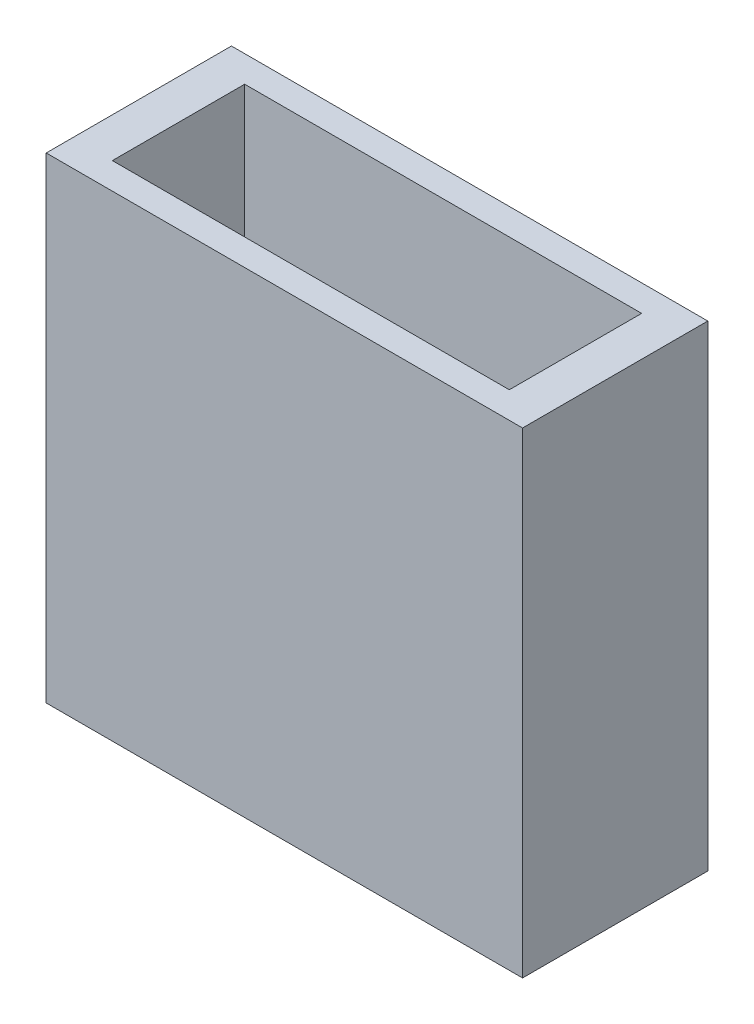
ISO-10303-21;
HEADER;
FILE_DESCRIPTION(('STEP AP214'),'2;1');
FILE_NAME('part.step','',(''),(''),'','','');
FILE_SCHEMA(('AUTOMOTIVE_DESIGN { 1 0 10303 214 1 1 1 1 }'));
ENDSEC;
DATA;
#1=APPLICATION_CONTEXT('core data for automotive mechanical design processes');
#2=APPLICATION_PROTOCOL_DEFINITION('international standard','automotive_design',2000,#1);
#3=PRODUCT_CONTEXT('',#1,'mechanical');
#4=PRODUCT('Part','Part','',(#3));
#5=PRODUCT_RELATED_PRODUCT_CATEGORY('part','',(#4));
#6=PRODUCT_DEFINITION_FORMATION('','',#4);
#7=PRODUCT_DEFINITION_CONTEXT('part definition',#1,'design');
#8=PRODUCT_DEFINITION('design','',#6,#7);
#9=PRODUCT_DEFINITION_SHAPE('','',#8);
#10=(LENGTH_UNIT() NAMED_UNIT(*) SI_UNIT(.MILLI.,.METRE.));
#11=(NAMED_UNIT(*) PLANE_ANGLE_UNIT() SI_UNIT($,.RADIAN.));
#12=(NAMED_UNIT(*) SI_UNIT($,.STERADIAN.) SOLID_ANGLE_UNIT());
#13=UNCERTAINTY_MEASURE_WITH_UNIT(LENGTH_MEASURE(1.E-05),#10,'distance_accuracy_value','');
#14=(GEOMETRIC_REPRESENTATION_CONTEXT(3) GLOBAL_UNCERTAINTY_ASSIGNED_CONTEXT((#13)) GLOBAL_UNIT_ASSIGNED_CONTEXT((#10,
#11,#12)) REPRESENTATION_CONTEXT('',''));
#15=CARTESIAN_POINT('',(0.,0.,0.));
#16=DIRECTION('',(0.,0.,1.));
#17=DIRECTION('',(1.,0.,0.));
#18=AXIS2_PLACEMENT_3D('',#15,#16,#17);
#19=CARTESIAN_POINT('',(0.,45.72,0.));
#20=DIRECTION('',(1.,0.,0.));
#21=DIRECTION('',(0.,0.,-1.));
#22=AXIS2_PLACEMENT_3D('',#19,#20,#21);
#23=PLANE('',#22);
#24=DIRECTION('',(0.,0.,1.));
#25=VECTOR('',#24,1.);
#26=CARTESIAN_POINT('',(0.,0.,0.));
#27=LINE('',#26,#25);
#28=CARTESIAN_POINT('',(0.,0.,-17.78));
#29=VERTEX_POINT('',#28);
#30=CARTESIAN_POINT('',(0.,0.,0.));
#31=VERTEX_POINT('',#30);
#32=EDGE_CURVE('E166',#29,#31,#27,.T.);
#33=ORIENTED_EDGE('',*,*,#32,.T.);
#34=DIRECTION('',(0.,-1.,0.));
#35=VECTOR('',#34,1.);
#36=CARTESIAN_POINT('',(0.,45.72,0.));
#37=LINE('',#36,#35);
#38=CARTESIAN_POINT('',(0.,45.72,0.));
#39=VERTEX_POINT('',#38);
#40=EDGE_CURVE('E11',#39,#31,#37,.T.);
#41=ORIENTED_EDGE('',*,*,#40,.F.);
#42=DIRECTION('',(0.,0.,1.));
#43=VECTOR('',#42,1.);
#44=CARTESIAN_POINT('',(0.,45.72,0.));
#45=LINE('',#44,#43);
#46=CARTESIAN_POINT('',(0.,45.72,-17.78));
#47=VERTEX_POINT('',#46);
#48=EDGE_CURVE('E172',#47,#39,#45,.T.);
#49=ORIENTED_EDGE('',*,*,#48,.F.);
#50=DIRECTION('',(0.,-1.,0.));
#51=VECTOR('',#50,1.);
#52=CARTESIAN_POINT('',(0.,45.72,-17.78));
#53=LINE('',#52,#51);
#54=EDGE_CURVE('E182',#47,#29,#53,.T.);
#55=ORIENTED_EDGE('',*,*,#54,.T.);
#56=EDGE_LOOP('',(#33,#41,#49,#55));
#57=FACE_BOUND('',#56,.T.);
#58=ADVANCED_FACE('F42',(#57),#23,.F.);
#59=CARTESIAN_POINT('',(0.,45.72,0.));
#60=DIRECTION('',(0.,0.,-1.));
#61=DIRECTION('',(-1.,0.,0.));
#62=AXIS2_PLACEMENT_3D('',#59,#60,#61);
#63=PLANE('',#62);
#64=DIRECTION('',(1.,0.,0.));
#65=VECTOR('',#64,1.);
#66=CARTESIAN_POINT('',(0.,0.,0.));
#67=LINE('',#66,#65);
#68=CARTESIAN_POINT('',(45.72,0.,0.));
#69=VERTEX_POINT('',#68);
#70=EDGE_CURVE('E186',#31,#69,#67,.T.);
#71=ORIENTED_EDGE('',*,*,#70,.T.);
#72=DIRECTION('',(0.,-1.,0.));
#73=VECTOR('',#72,1.);
#74=CARTESIAN_POINT('',(45.72,45.72,0.));
#75=LINE('',#74,#73);
#76=CARTESIAN_POINT('',(45.72,45.72,0.));
#77=VERTEX_POINT('',#76);
#78=EDGE_CURVE('E51',#77,#69,#75,.T.);
#79=ORIENTED_EDGE('',*,*,#78,.F.);
#80=DIRECTION('',(1.,0.,0.));
#81=VECTOR('',#80,1.);
#82=CARTESIAN_POINT('',(0.,45.72,0.));
#83=LINE('',#82,#81);
#84=EDGE_CURVE('E96',#39,#77,#83,.T.);
#85=ORIENTED_EDGE('',*,*,#84,.F.);
#86=ORIENTED_EDGE('',*,*,#40,.T.);
#87=EDGE_LOOP('',(#71,#79,#85,#86));
#88=FACE_BOUND('',#87,.T.);
#89=ADVANCED_FACE('F235',(#88),#63,.F.);
#90=CARTESIAN_POINT('',(45.72,45.72,0.));
#91=DIRECTION('',(-1.,0.,0.));
#92=DIRECTION('',(0.,0.,1.));
#93=AXIS2_PLACEMENT_3D('',#90,#91,#92);
#94=PLANE('',#93);
#95=DIRECTION('',(0.,0.,-1.));
#96=VECTOR('',#95,1.);
#97=CARTESIAN_POINT('',(45.72,0.,0.));
#98=LINE('',#97,#96);
#99=CARTESIAN_POINT('',(45.72,0.,-17.78));
#100=VERTEX_POINT('',#99);
#101=EDGE_CURVE('E189',#69,#100,#98,.T.);
#102=ORIENTED_EDGE('',*,*,#101,.T.);
#103=DIRECTION('',(0.,-1.,0.));
#104=VECTOR('',#103,1.);
#105=CARTESIAN_POINT('',(45.72,45.72,-17.78));
#106=LINE('',#105,#104);
#107=CARTESIAN_POINT('',(45.72,45.72,-17.78));
#108=VERTEX_POINT('',#107);
#109=EDGE_CURVE('E196',#108,#100,#106,.T.);
#110=ORIENTED_EDGE('',*,*,#109,.F.);
#111=DIRECTION('',(0.,0.,-1.));
#112=VECTOR('',#111,1.);
#113=CARTESIAN_POINT('',(45.72,45.72,0.));
#114=LINE('',#113,#112);
#115=EDGE_CURVE('E177',#77,#108,#114,.T.);
#116=ORIENTED_EDGE('',*,*,#115,.F.);
#117=ORIENTED_EDGE('',*,*,#78,.T.);
#118=EDGE_LOOP('',(#102,#110,#116,#117));
#119=FACE_BOUND('',#118,.T.);
#120=ADVANCED_FACE('F240',(#119),#94,.F.);
#121=CARTESIAN_POINT('',(0.,45.72,-17.78));
#122=DIRECTION('',(0.,0.,1.));
#123=DIRECTION('',(1.,0.,0.));
#124=AXIS2_PLACEMENT_3D('',#121,#122,#123);
#125=PLANE('',#124);
#126=DIRECTION('',(-1.,0.,0.));
#127=VECTOR('',#126,1.);
#128=CARTESIAN_POINT('',(0.,0.,-17.78));
#129=LINE('',#128,#127);
#130=EDGE_CURVE('E89',#100,#29,#129,.T.);
#131=ORIENTED_EDGE('',*,*,#130,.T.);
#132=ORIENTED_EDGE('',*,*,#54,.F.);
#133=DIRECTION('',(-1.,0.,0.));
#134=VECTOR('',#133,1.);
#135=CARTESIAN_POINT('',(0.,45.72,-17.78));
#136=LINE('',#135,#134);
#137=EDGE_CURVE('E68',#108,#47,#136,.T.);
#138=ORIENTED_EDGE('',*,*,#137,.F.);
#139=ORIENTED_EDGE('',*,*,#109,.T.);
#140=EDGE_LOOP('',(#131,#132,#138,#139));
#141=FACE_BOUND('',#140,.T.);
#142=ADVANCED_FACE('F252',(#141),#125,.F.);
#143=CARTESIAN_POINT('',(0.,45.72,0.));
#144=DIRECTION('',(0.,-1.,0.));
#145=DIRECTION('',(0.,0.,-1.));
#146=AXIS2_PLACEMENT_3D('',#143,#144,#145);
#147=PLANE('',#146);
#148=DIRECTION('',(1.,0.,0.));
#149=VECTOR('',#148,1.);
#150=CARTESIAN_POINT('',(3.81,45.72,-2.54));
#151=LINE('',#150,#149);
#152=CARTESIAN_POINT('',(3.81,45.72,-2.54));
#153=VERTEX_POINT('',#152);
#154=CARTESIAN_POINT('',(41.91,45.72,-2.54));
#155=VERTEX_POINT('',#154);
#156=EDGE_CURVE('E157',#153,#155,#151,.T.);
#157=ORIENTED_EDGE('',*,*,#156,.F.);
#158=DIRECTION('',(0.,0.,1.));
#159=VECTOR('',#158,1.);
#160=CARTESIAN_POINT('',(3.81,45.72,-2.54));
#161=LINE('',#160,#159);
#162=CARTESIAN_POINT('',(3.81,45.72,-15.24));
#163=VERTEX_POINT('',#162);
#164=EDGE_CURVE('E59',#163,#153,#161,.T.);
#165=ORIENTED_EDGE('',*,*,#164,.F.);
#166=DIRECTION('',(-1.,0.,0.));
#167=VECTOR('',#166,1.);
#168=CARTESIAN_POINT('',(3.81,45.72,-15.24));
#169=LINE('',#168,#167);
#170=CARTESIAN_POINT('',(41.91,45.72,-15.24));
#171=VERTEX_POINT('',#170);
#172=EDGE_CURVE('E141',#171,#163,#169,.T.);
#173=ORIENTED_EDGE('',*,*,#172,.F.);
#174=DIRECTION('',(0.,0.,-1.));
#175=VECTOR('',#174,1.);
#176=CARTESIAN_POINT('',(41.91,45.72,-2.54));
#177=LINE('',#176,#175);
#178=EDGE_CURVE('E145',#155,#171,#177,.T.);
#179=ORIENTED_EDGE('',*,*,#178,.F.);
#180=EDGE_LOOP('',(#157,#165,#173,#179));
#181=FACE_BOUND('',#180,.T.);
#182=ORIENTED_EDGE('',*,*,#48,.T.);
#183=ORIENTED_EDGE('',*,*,#84,.T.);
#184=ORIENTED_EDGE('',*,*,#115,.T.);
#185=ORIENTED_EDGE('',*,*,#137,.T.);
#186=EDGE_LOOP('',(#182,#183,#184,#185));
#187=FACE_BOUND('',#186,.T.);
#188=ADVANCED_FACE('F250',(#181,#187),#147,.F.);
#189=CARTESIAN_POINT('',(0.,0.,0.));
#190=DIRECTION('',(0.,-1.,0.));
#191=DIRECTION('',(0.,0.,-1.));
#192=AXIS2_PLACEMENT_3D('',#189,#190,#191);
#193=PLANE('',#192);
#194=CARTESIAN_POINT('',(28.702,0.,-8.89));
#195=DIRECTION('',(0.,1.,0.));
#196=DIRECTION('',(0.,0.,1.));
#197=AXIS2_PLACEMENT_3D('',#194,#195,#196);
#198=CIRCLE('',#197,2.54);
#199=CARTESIAN_POINT('',(28.702,0.,-6.35));
#200=VERTEX_POINT('',#199);
#201=EDGE_CURVE('E386',#200,#200,#198,.T.);
#202=ORIENTED_EDGE('',*,*,#201,.T.);
#203=EDGE_LOOP('',(#202));
#204=FACE_BOUND('',#203,.T.);
#205=CARTESIAN_POINT('',(17.018,0.,-8.89));
#206=DIRECTION('',(0.,1.,0.));
#207=DIRECTION('',(0.,0.,1.));
#208=AXIS2_PLACEMENT_3D('',#205,#206,#207);
#209=CIRCLE('',#208,2.54);
#210=CARTESIAN_POINT('',(17.018,0.,-6.35));
#211=VERTEX_POINT('',#210);
#212=EDGE_CURVE('E388',#211,#211,#209,.T.);
#213=ORIENTED_EDGE('',*,*,#212,.T.);
#214=EDGE_LOOP('',(#213));
#215=FACE_BOUND('',#214,.T.);
#216=CARTESIAN_POINT('',(22.86,0.,-8.89));
#217=DIRECTION('',(0.,1.,0.));
#218=DIRECTION('',(0.,0.,1.));
#219=AXIS2_PLACEMENT_3D('',#216,#217,#218);
#220=CIRCLE('',#219,2.4765);
#221=CARTESIAN_POINT('',(22.86,0.,-6.4135));
#222=VERTEX_POINT('',#221);
#223=EDGE_CURVE('E148',#222,#222,#220,.T.);
#224=ORIENTED_EDGE('',*,*,#223,.T.);
#225=EDGE_LOOP('',(#224));
#226=FACE_BOUND('',#225,.T.);
#227=ORIENTED_EDGE('',*,*,#32,.F.);
#228=ORIENTED_EDGE('',*,*,#130,.F.);
#229=ORIENTED_EDGE('',*,*,#101,.F.);
#230=ORIENTED_EDGE('',*,*,#70,.F.);
#231=EDGE_LOOP('',(#227,#228,#229,#230));
#232=FACE_BOUND('',#231,.T.);
#233=ADVANCED_FACE('F245',(#204,#215,#226,#232),#193,.T.);
#234=CARTESIAN_POINT('',(3.81,3.81,-2.54));
#235=DIRECTION('',(-1.,0.,0.));
#236=DIRECTION('',(0.,0.,1.));
#237=AXIS2_PLACEMENT_3D('',#234,#235,#236);
#238=PLANE('',#237);
#239=ORIENTED_EDGE('',*,*,#164,.T.);
#240=DIRECTION('',(0.,1.,0.));
#241=VECTOR('',#240,1.);
#242=CARTESIAN_POINT('',(3.81,3.81,-2.54));
#243=LINE('',#242,#241);
#244=CARTESIAN_POINT('',(3.81,3.81,-2.54));
#245=VERTEX_POINT('',#244);
#246=EDGE_CURVE('E116',#245,#153,#243,.T.);
#247=ORIENTED_EDGE('',*,*,#246,.F.);
#248=DIRECTION('',(0.,0.,1.));
#249=VECTOR('',#248,1.);
#250=CARTESIAN_POINT('',(3.81,3.81,-2.54));
#251=LINE('',#250,#249);
#252=CARTESIAN_POINT('',(3.81,3.81,-15.24));
#253=VERTEX_POINT('',#252);
#254=EDGE_CURVE('E120',#253,#245,#251,.T.);
#255=ORIENTED_EDGE('',*,*,#254,.F.);
#256=DIRECTION('',(0.,1.,0.));
#257=VECTOR('',#256,1.);
#258=CARTESIAN_POINT('',(3.81,3.81,-15.24));
#259=LINE('',#258,#257);
#260=EDGE_CURVE('E163',#253,#163,#259,.T.);
#261=ORIENTED_EDGE('',*,*,#260,.T.);
#262=EDGE_LOOP('',(#239,#247,#255,#261));
#263=FACE_BOUND('',#262,.T.);
#264=ADVANCED_FACE('F118',(#263),#238,.F.);
#265=CARTESIAN_POINT('',(3.81,3.81,-15.24));
#266=DIRECTION('',(0.,0.,-1.));
#267=DIRECTION('',(-1.,0.,0.));
#268=AXIS2_PLACEMENT_3D('',#265,#266,#267);
#269=PLANE('',#268);
#270=ORIENTED_EDGE('',*,*,#172,.T.);
#271=ORIENTED_EDGE('',*,*,#260,.F.);
#272=DIRECTION('',(-1.,0.,0.));
#273=VECTOR('',#272,1.);
#274=CARTESIAN_POINT('',(3.81,3.81,-15.24));
#275=LINE('',#274,#273);
#276=CARTESIAN_POINT('',(41.91,3.81,-15.24));
#277=VERTEX_POINT('',#276);
#278=EDGE_CURVE('E127',#277,#253,#275,.T.);
#279=ORIENTED_EDGE('',*,*,#278,.F.);
#280=DIRECTION('',(0.,1.,0.));
#281=VECTOR('',#280,1.);
#282=CARTESIAN_POINT('',(41.91,3.81,-15.24));
#283=LINE('',#282,#281);
#284=EDGE_CURVE('E167',#277,#171,#283,.T.);
#285=ORIENTED_EDGE('',*,*,#284,.T.);
#286=EDGE_LOOP('',(#270,#271,#279,#285));
#287=FACE_BOUND('',#286,.T.);
#288=ADVANCED_FACE('F290',(#287),#269,.F.);
#289=CARTESIAN_POINT('',(41.91,3.81,-2.54));
#290=DIRECTION('',(1.,0.,0.));
#291=DIRECTION('',(0.,0.,-1.));
#292=AXIS2_PLACEMENT_3D('',#289,#290,#291);
#293=PLANE('',#292);
#294=ORIENTED_EDGE('',*,*,#178,.T.);
#295=ORIENTED_EDGE('',*,*,#284,.F.);
#296=DIRECTION('',(0.,0.,-1.));
#297=VECTOR('',#296,1.);
#298=CARTESIAN_POINT('',(41.91,3.81,-2.54));
#299=LINE('',#298,#297);
#300=CARTESIAN_POINT('',(41.91,3.81,-2.54));
#301=VERTEX_POINT('',#300);
#302=EDGE_CURVE('E136',#301,#277,#299,.T.);
#303=ORIENTED_EDGE('',*,*,#302,.F.);
#304=DIRECTION('',(0.,1.,0.));
#305=VECTOR('',#304,1.);
#306=CARTESIAN_POINT('',(41.91,3.81,-2.54));
#307=LINE('',#306,#305);
#308=EDGE_CURVE('E126',#301,#155,#307,.T.);
#309=ORIENTED_EDGE('',*,*,#308,.T.);
#310=EDGE_LOOP('',(#294,#295,#303,#309));
#311=FACE_BOUND('',#310,.T.);
#312=ADVANCED_FACE('F299',(#311),#293,.F.);
#313=CARTESIAN_POINT('',(3.81,3.81,-2.54));
#314=DIRECTION('',(0.,0.,1.));
#315=DIRECTION('',(1.,0.,0.));
#316=AXIS2_PLACEMENT_3D('',#313,#314,#315);
#317=PLANE('',#316);
#318=ORIENTED_EDGE('',*,*,#156,.T.);
#319=ORIENTED_EDGE('',*,*,#308,.F.);
#320=DIRECTION('',(1.,0.,0.));
#321=VECTOR('',#320,1.);
#322=CARTESIAN_POINT('',(3.81,3.81,-2.54));
#323=LINE('',#322,#321);
#324=EDGE_CURVE('E130',#245,#301,#323,.T.);
#325=ORIENTED_EDGE('',*,*,#324,.F.);
#326=ORIENTED_EDGE('',*,*,#246,.T.);
#327=EDGE_LOOP('',(#318,#319,#325,#326));
#328=FACE_BOUND('',#327,.T.);
#329=ADVANCED_FACE('F131',(#328),#317,.F.);
#330=CARTESIAN_POINT('',(0.,3.81,0.));
#331=DIRECTION('',(0.,-1.,0.));
#332=DIRECTION('',(0.,0.,-1.));
#333=AXIS2_PLACEMENT_3D('',#330,#331,#332);
#334=PLANE('',#333);
#335=CARTESIAN_POINT('',(28.702,3.81,-8.89));
#336=DIRECTION('',(0.,-1.,0.));
#337=DIRECTION('',(0.,0.,-1.));
#338=AXIS2_PLACEMENT_3D('',#335,#336,#337);
#339=CIRCLE('',#338,2.54);
#340=CARTESIAN_POINT('',(28.702,3.81,-11.43));
#341=VERTEX_POINT('',#340);
#342=EDGE_CURVE('E45',#341,#341,#339,.F.);
#343=ORIENTED_EDGE('',*,*,#342,.F.);
#344=EDGE_LOOP('',(#343));
#345=FACE_BOUND('',#344,.T.);
#346=CARTESIAN_POINT('',(17.018,3.81,-8.89));
#347=DIRECTION('',(0.,-1.,0.));
#348=DIRECTION('',(0.,0.,-1.));
#349=AXIS2_PLACEMENT_3D('',#346,#347,#348);
#350=CIRCLE('',#349,2.54);
#351=CARTESIAN_POINT('',(17.018,3.81,-11.43));
#352=VERTEX_POINT('',#351);
#353=EDGE_CURVE('E205',#352,#352,#350,.F.);
#354=ORIENTED_EDGE('',*,*,#353,.F.);
#355=EDGE_LOOP('',(#354));
#356=FACE_BOUND('',#355,.T.);
#357=CARTESIAN_POINT('',(22.86,3.81,-8.89));
#358=DIRECTION('',(0.,-1.,0.));
#359=DIRECTION('',(0.,0.,-1.));
#360=AXIS2_PLACEMENT_3D('',#357,#358,#359);
#361=CIRCLE('',#360,2.4765);
#362=CARTESIAN_POINT('',(22.86,3.81,-11.3665));
#363=VERTEX_POINT('',#362);
#364=EDGE_CURVE('E202',#363,#363,#361,.F.);
#365=ORIENTED_EDGE('',*,*,#364,.F.);
#366=EDGE_LOOP('',(#365));
#367=FACE_BOUND('',#366,.T.);
#368=ORIENTED_EDGE('',*,*,#254,.T.);
#369=ORIENTED_EDGE('',*,*,#324,.T.);
#370=ORIENTED_EDGE('',*,*,#302,.T.);
#371=ORIENTED_EDGE('',*,*,#278,.T.);
#372=EDGE_LOOP('',(#368,#369,#370,#371));
#373=FACE_BOUND('',#372,.T.);
#374=ADVANCED_FACE('F138',(#345,#356,#367,#373),#334,.F.);
#375=CARTESIAN_POINT('',(22.86,45.72,-8.89));
#376=DIRECTION('',(0.,-1.,0.));
#377=DIRECTION('',(0.,0.,-1.));
#378=AXIS2_PLACEMENT_3D('',#375,#376,#377);
#379=CYLINDRICAL_SURFACE('',#378,2.4765);
#380=ORIENTED_EDGE('',*,*,#223,.F.);
#381=EDGE_LOOP('',(#380));
#382=FACE_BOUND('',#381,.T.);
#383=ORIENTED_EDGE('',*,*,#364,.T.);
#384=EDGE_LOOP('',(#383));
#385=FACE_BOUND('',#384,.T.);
#386=ADVANCED_FACE('F218',(#382,#385),#379,.F.);
#387=CARTESIAN_POINT('',(17.018,45.72,-8.89));
#388=DIRECTION('',(0.,-1.,0.));
#389=DIRECTION('',(0.,0.,-1.));
#390=AXIS2_PLACEMENT_3D('',#387,#388,#389);
#391=CYLINDRICAL_SURFACE('',#390,2.54);
#392=ORIENTED_EDGE('',*,*,#212,.F.);
#393=EDGE_LOOP('',(#392));
#394=FACE_BOUND('',#393,.T.);
#395=ORIENTED_EDGE('',*,*,#353,.T.);
#396=EDGE_LOOP('',(#395));
#397=FACE_BOUND('',#396,.T.);
#398=ADVANCED_FACE('F224',(#394,#397),#391,.F.);
#399=CARTESIAN_POINT('',(28.702,45.72,-8.89));
#400=DIRECTION('',(0.,-1.,0.));
#401=DIRECTION('',(0.,0.,-1.));
#402=AXIS2_PLACEMENT_3D('',#399,#400,#401);
#403=CYLINDRICAL_SURFACE('',#402,2.54);
#404=ORIENTED_EDGE('',*,*,#201,.F.);
#405=EDGE_LOOP('',(#404));
#406=FACE_BOUND('',#405,.T.);
#407=ORIENTED_EDGE('',*,*,#342,.T.);
#408=EDGE_LOOP('',(#407));
#409=FACE_BOUND('',#408,.T.);
#410=ADVANCED_FACE('F214',(#406,#409),#403,.F.);
#411=CLOSED_SHELL('',(#58,#89,#120,#142,#188,#233,#264,#288,#312,#329,#374,#386,#398,#410));
#412=MANIFOLD_SOLID_BREP('B2',#411);
#413=ADVANCED_BREP_SHAPE_REPRESENTATION('',(#18,#412),#14);
#414=SHAPE_DEFINITION_REPRESENTATION(#9,#413);
ENDSEC;
END-ISO-10303-21;
